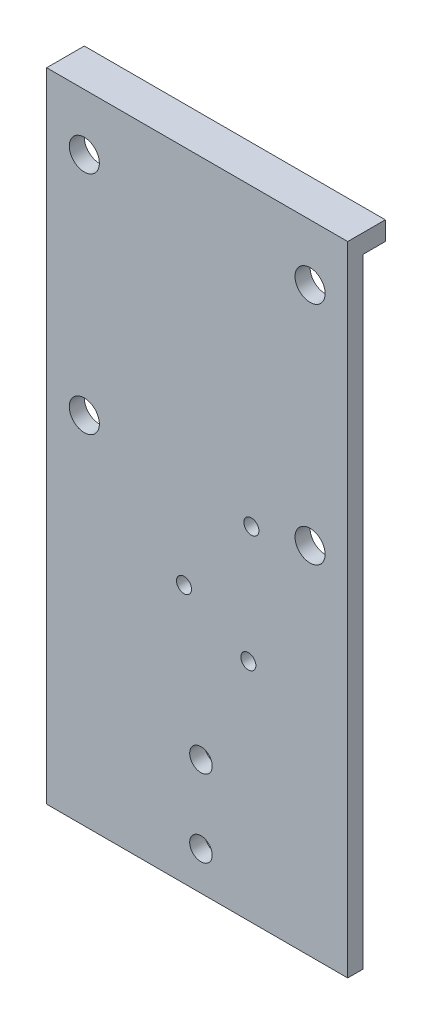
ISO-10303-21;
HEADER;
FILE_DESCRIPTION(('STEP AP214'),'2;1');
FILE_NAME('part.step','',(''),(''),'','','');
FILE_SCHEMA(('AUTOMOTIVE_DESIGN { 1 0 10303 214 1 1 1 1 }'));
ENDSEC;
DATA;
#1=APPLICATION_CONTEXT('core data for automotive mechanical design processes');
#2=APPLICATION_PROTOCOL_DEFINITION('international standard','automotive_design',2000,#1);
#3=PRODUCT_CONTEXT('',#1,'mechanical');
#4=PRODUCT('Part','Part','',(#3));
#5=PRODUCT_RELATED_PRODUCT_CATEGORY('part','',(#4));
#6=PRODUCT_DEFINITION_FORMATION('','',#4);
#7=PRODUCT_DEFINITION_CONTEXT('part definition',#1,'design');
#8=PRODUCT_DEFINITION('design','',#6,#7);
#9=PRODUCT_DEFINITION_SHAPE('','',#8);
#10=(LENGTH_UNIT() NAMED_UNIT(*) SI_UNIT(.MILLI.,.METRE.));
#11=(NAMED_UNIT(*) PLANE_ANGLE_UNIT() SI_UNIT($,.RADIAN.));
#12=(NAMED_UNIT(*) SI_UNIT($,.STERADIAN.) SOLID_ANGLE_UNIT());
#13=UNCERTAINTY_MEASURE_WITH_UNIT(LENGTH_MEASURE(1.E-05),#10,'distance_accuracy_value','');
#14=(GEOMETRIC_REPRESENTATION_CONTEXT(3) GLOBAL_UNCERTAINTY_ASSIGNED_CONTEXT((#13)) GLOBAL_UNIT_ASSIGNED_CONTEXT((#10,
#11,#12)) REPRESENTATION_CONTEXT('',''));
#15=CARTESIAN_POINT('',(0.,0.,0.));
#16=DIRECTION('',(0.,0.,1.));
#17=DIRECTION('',(1.,0.,0.));
#18=AXIS2_PLACEMENT_3D('',#15,#16,#17);
#19=CARTESIAN_POINT('',(0.,0.,0.));
#20=DIRECTION('',(0.,0.,1.));
#21=DIRECTION('',(1.,0.,0.));
#22=AXIS2_PLACEMENT_3D('',#19,#20,#21);
#23=PLANE('',#22);
#24=CARTESIAN_POINT('',(24.5909669585694,-58.8944881889764,0.));
#25=DIRECTION('',(0.,0.,1.));
#26=DIRECTION('',(1.,0.,0.));
#27=AXIS2_PLACEMENT_3D('',#24,#25,#26);
#28=CIRCLE('',#27,2.00000000000001);
#29=CARTESIAN_POINT('',(26.5909669585694,-58.8944881889764,0.));
#30=VERTEX_POINT('',#29);
#31=EDGE_CURVE('E287',#30,#30,#28,.T.);
#32=ORIENTED_EDGE('',*,*,#31,.T.);
#33=EDGE_LOOP('',(#32));
#34=FACE_BOUND('',#33,.T.);
#35=CARTESIAN_POINT('',(25.3909669585694,-27.4944881889764,0.));
#36=DIRECTION('',(0.,0.,1.));
#37=DIRECTION('',(1.,0.,0.));
#38=AXIS2_PLACEMENT_3D('',#35,#36,#37);
#39=CIRCLE('',#38,2.);
#40=CARTESIAN_POINT('',(27.3909669585695,-27.4944881889764,0.));
#41=VERTEX_POINT('',#40);
#42=EDGE_CURVE('E289',#41,#41,#39,.T.);
#43=ORIENTED_EDGE('',*,*,#42,.T.);
#44=EDGE_LOOP('',(#43));
#45=FACE_BOUND('',#44,.T.);
#46=CARTESIAN_POINT('',(7.49096695856945,-49.8944881889764,0.));
#47=DIRECTION('',(0.,0.,1.));
#48=DIRECTION('',(1.,0.,0.));
#49=AXIS2_PLACEMENT_3D('',#46,#47,#48);
#50=CIRCLE('',#49,2.);
#51=CARTESIAN_POINT('',(9.49096695856945,-49.8944881889764,0.));
#52=VERTEX_POINT('',#51);
#53=EDGE_CURVE('E129',#52,#52,#50,.T.);
#54=ORIENTED_EDGE('',*,*,#53,.T.);
#55=EDGE_LOOP('',(#54));
#56=FACE_BOUND('',#55,.T.);
#57=CARTESIAN_POINT('',(-19.0090330414306,35.9055118110236,0.));
#58=DIRECTION('',(0.,0.,1.));
#59=DIRECTION('',(1.,0.,0.));
#60=AXIS2_PLACEMENT_3D('',#57,#58,#59);
#61=CIRCLE('',#60,4.);
#62=CARTESIAN_POINT('',(-15.0090330414306,35.9055118110236,0.));
#63=VERTEX_POINT('',#62);
#64=EDGE_CURVE('E163',#63,#63,#61,.T.);
#65=ORIENTED_EDGE('',*,*,#64,.T.);
#66=EDGE_LOOP('',(#65));
#67=FACE_BOUND('',#66,.T.);
#68=CARTESIAN_POINT('',(40.9909669585695,35.9055118110236,0.));
#69=DIRECTION('',(0.,0.,1.));
#70=DIRECTION('',(1.,0.,0.));
#71=AXIS2_PLACEMENT_3D('',#68,#69,#70);
#72=CIRCLE('',#71,4.00000000000001);
#73=CARTESIAN_POINT('',(44.9909669585695,35.9055118110236,0.));
#74=VERTEX_POINT('',#73);
#75=EDGE_CURVE('E157',#74,#74,#72,.T.);
#76=ORIENTED_EDGE('',*,*,#75,.T.);
#77=EDGE_LOOP('',(#76));
#78=FACE_BOUND('',#77,.T.);
#79=CARTESIAN_POINT('',(-19.0090330414305,-24.0944881889764,0.));
#80=DIRECTION('',(0.,0.,1.));
#81=DIRECTION('',(1.,0.,0.));
#82=AXIS2_PLACEMENT_3D('',#79,#80,#81);
#83=CIRCLE('',#82,4.);
#84=CARTESIAN_POINT('',(-15.0090330414305,-24.0944881889764,0.));
#85=VERTEX_POINT('',#84);
#86=EDGE_CURVE('E151',#85,#85,#83,.T.);
#87=ORIENTED_EDGE('',*,*,#86,.T.);
#88=EDGE_LOOP('',(#87));
#89=FACE_BOUND('',#88,.T.);
#90=CARTESIAN_POINT('',(40.9909669585695,-24.0944881889764,0.));
#91=DIRECTION('',(0.,0.,1.));
#92=DIRECTION('',(1.,0.,0.));
#93=AXIS2_PLACEMENT_3D('',#90,#91,#92);
#94=CIRCLE('',#93,4.);
#95=CARTESIAN_POINT('',(44.9909669585695,-24.0944881889764,0.));
#96=VERTEX_POINT('',#95);
#97=EDGE_CURVE('E145',#96,#96,#94,.T.);
#98=ORIENTED_EDGE('',*,*,#97,.T.);
#99=EDGE_LOOP('',(#98));
#100=FACE_BOUND('',#99,.T.);
#101=CARTESIAN_POINT('',(11.9909669585695,-108.344488188976,0.));
#102=DIRECTION('',(0.,0.,1.));
#103=DIRECTION('',(1.,0.,0.));
#104=AXIS2_PLACEMENT_3D('',#101,#102,#103);
#105=CIRCLE('',#104,3.);
#106=CARTESIAN_POINT('',(14.9909669585695,-108.344488188976,0.));
#107=VERTEX_POINT('',#106);
#108=EDGE_CURVE('E139',#107,#107,#105,.T.);
#109=ORIENTED_EDGE('',*,*,#108,.T.);
#110=EDGE_LOOP('',(#109));
#111=FACE_BOUND('',#110,.T.);
#112=CARTESIAN_POINT('',(11.9909669585695,-87.8444881889764,0.));
#113=DIRECTION('',(0.,0.,1.));
#114=DIRECTION('',(1.,0.,0.));
#115=AXIS2_PLACEMENT_3D('',#112,#113,#114);
#116=CIRCLE('',#115,3.);
#117=CARTESIAN_POINT('',(14.9909669585695,-87.8444881889764,0.));
#118=VERTEX_POINT('',#117);
#119=EDGE_CURVE('E121',#118,#118,#116,.T.);
#120=ORIENTED_EDGE('',*,*,#119,.T.);
#121=EDGE_LOOP('',(#120));
#122=FACE_BOUND('',#121,.T.);
#123=DIRECTION('',(-1.,0.,0.));
#124=VECTOR('',#123,1.);
#125=CARTESIAN_POINT('',(50.9909669585694,45.9055118110236,0.));
#126=LINE('',#125,#124);
#127=CARTESIAN_POINT('',(50.9909669585694,45.9055118110236,0.));
#128=VERTEX_POINT('',#127);
#129=CARTESIAN_POINT('',(-29.0090330414306,45.9055118110236,0.));
#130=VERTEX_POINT('',#129);
#131=EDGE_CURVE('E50',#128,#130,#126,.T.);
#132=ORIENTED_EDGE('',*,*,#131,.F.);
#133=DIRECTION('',(0.,1.,0.));
#134=VECTOR('',#133,1.);
#135=CARTESIAN_POINT('',(50.9909669585694,50.9055118110236,0.));
#136=LINE('',#135,#134);
#137=CARTESIAN_POINT('',(50.9909669585695,-118.594488188976,0.));
#138=VERTEX_POINT('',#137);
#139=EDGE_CURVE('E118',#138,#128,#136,.T.);
#140=ORIENTED_EDGE('',*,*,#139,.F.);
#141=DIRECTION('',(1.,0.,0.));
#142=VECTOR('',#141,1.);
#143=CARTESIAN_POINT('',(-29.0090330414305,-118.594488188976,0.));
#144=LINE('',#143,#142);
#145=CARTESIAN_POINT('',(-29.0090330414305,-118.594488188976,0.));
#146=VERTEX_POINT('',#145);
#147=EDGE_CURVE('E74',#146,#138,#144,.T.);
#148=ORIENTED_EDGE('',*,*,#147,.F.);
#149=DIRECTION('',(0.,-1.,0.));
#150=VECTOR('',#149,1.);
#151=CARTESIAN_POINT('',(-29.0090330414306,50.9055118110236,0.));
#152=LINE('',#151,#150);
#153=EDGE_CURVE('E166',#130,#146,#152,.T.);
#154=ORIENTED_EDGE('',*,*,#153,.F.);
#155=EDGE_LOOP('',(#132,#140,#148,#154));
#156=FACE_BOUND('',#155,.T.);
#157=ADVANCED_FACE('F33',(#34,#45,#56,#67,#78,#89,#100,#111,#122,#156),#23,.F.);
#158=CARTESIAN_POINT('',(-29.0090330414306,50.9055118110236,4.));
#159=DIRECTION('',(1.,0.,0.));
#160=DIRECTION('',(0.,1.,0.));
#161=AXIS2_PLACEMENT_3D('',#158,#159,#160);
#162=PLANE('',#161);
#163=DIRECTION('',(0.,0.,-1.));
#164=VECTOR('',#163,1.);
#165=CARTESIAN_POINT('',(-29.0090330414306,50.9055118110236,4.));
#166=LINE('',#165,#164);
#167=CARTESIAN_POINT('',(-29.0090330414306,50.9055118110236,4.));
#168=VERTEX_POINT('',#167);
#169=CARTESIAN_POINT('',(-29.0090330414306,50.9055118110236,-6.));
#170=VERTEX_POINT('',#169);
#171=EDGE_CURVE('E175',#168,#170,#166,.T.);
#172=ORIENTED_EDGE('',*,*,#171,.T.);
#173=DIRECTION('',(0.,1.,0.));
#174=VECTOR('',#173,1.);
#175=CARTESIAN_POINT('',(-29.0090330414306,50.9055118110236,-6.));
#176=LINE('',#175,#174);
#177=CARTESIAN_POINT('',(-29.0090330414306,45.9055118110236,-6.));
#178=VERTEX_POINT('',#177);
#179=EDGE_CURVE('E106',#178,#170,#176,.T.);
#180=ORIENTED_EDGE('',*,*,#179,.F.);
#181=DIRECTION('',(0.,0.,1.));
#182=VECTOR('',#181,1.);
#183=CARTESIAN_POINT('',(-29.0090330414306,45.9055118110236,-6.));
#184=LINE('',#183,#182);
#185=EDGE_CURVE('E102',#178,#130,#184,.T.);
#186=ORIENTED_EDGE('',*,*,#185,.T.);
#187=ORIENTED_EDGE('',*,*,#153,.T.);
#188=DIRECTION('',(0.,0.,-1.));
#189=VECTOR('',#188,1.);
#190=CARTESIAN_POINT('',(-29.0090330414305,-118.594488188976,4.));
#191=LINE('',#190,#189);
#192=CARTESIAN_POINT('',(-29.0090330414305,-118.594488188976,4.));
#193=VERTEX_POINT('',#192);
#194=EDGE_CURVE('E11',#193,#146,#191,.T.);
#195=ORIENTED_EDGE('',*,*,#194,.F.);
#196=DIRECTION('',(0.,-1.,0.));
#197=VECTOR('',#196,1.);
#198=CARTESIAN_POINT('',(-29.0090330414306,50.9055118110236,4.));
#199=LINE('',#198,#197);
#200=EDGE_CURVE('E169',#168,#193,#199,.T.);
#201=ORIENTED_EDGE('',*,*,#200,.F.);
#202=EDGE_LOOP('',(#172,#180,#186,#187,#195,#201));
#203=FACE_BOUND('',#202,.T.);
#204=ADVANCED_FACE('F35',(#203),#162,.F.);
#205=CARTESIAN_POINT('',(-29.0090330414305,-118.594488188976,4.));
#206=DIRECTION('',(0.,1.,0.));
#207=DIRECTION('',(0.,0.,1.));
#208=AXIS2_PLACEMENT_3D('',#205,#206,#207);
#209=PLANE('',#208);
#210=ORIENTED_EDGE('',*,*,#147,.T.);
#211=DIRECTION('',(0.,0.,-1.));
#212=VECTOR('',#211,1.);
#213=CARTESIAN_POINT('',(50.9909669585695,-118.594488188976,4.));
#214=LINE('',#213,#212);
#215=CARTESIAN_POINT('',(50.9909669585695,-118.594488188976,4.));
#216=VERTEX_POINT('',#215);
#217=EDGE_CURVE('E42',#216,#138,#214,.T.);
#218=ORIENTED_EDGE('',*,*,#217,.F.);
#219=DIRECTION('',(1.,0.,0.));
#220=VECTOR('',#219,1.);
#221=CARTESIAN_POINT('',(-29.0090330414305,-118.594488188976,4.));
#222=LINE('',#221,#220);
#223=EDGE_CURVE('E79',#193,#216,#222,.T.);
#224=ORIENTED_EDGE('',*,*,#223,.F.);
#225=ORIENTED_EDGE('',*,*,#194,.T.);
#226=EDGE_LOOP('',(#210,#218,#224,#225));
#227=FACE_BOUND('',#226,.T.);
#228=ADVANCED_FACE('F190',(#227),#209,.F.);
#229=CARTESIAN_POINT('',(50.9909669585694,50.9055118110236,4.));
#230=DIRECTION('',(-1.,0.,0.));
#231=DIRECTION('',(0.,-1.,0.));
#232=AXIS2_PLACEMENT_3D('',#229,#230,#231);
#233=PLANE('',#232);
#234=ORIENTED_EDGE('',*,*,#139,.T.);
#235=DIRECTION('',(0.,0.,1.));
#236=VECTOR('',#235,1.);
#237=CARTESIAN_POINT('',(50.9909669585694,45.9055118110236,-6.));
#238=LINE('',#237,#236);
#239=CARTESIAN_POINT('',(50.9909669585694,45.9055118110236,-6.));
#240=VERTEX_POINT('',#239);
#241=EDGE_CURVE('E100',#240,#128,#238,.T.);
#242=ORIENTED_EDGE('',*,*,#241,.F.);
#243=DIRECTION('',(0.,-1.,0.));
#244=VECTOR('',#243,1.);
#245=CARTESIAN_POINT('',(50.9909669585694,50.9055118110236,-6.));
#246=LINE('',#245,#244);
#247=CARTESIAN_POINT('',(50.9909669585694,50.9055118110236,-6.));
#248=VERTEX_POINT('',#247);
#249=EDGE_CURVE('E107',#248,#240,#246,.T.);
#250=ORIENTED_EDGE('',*,*,#249,.F.);
#251=DIRECTION('',(0.,0.,-1.));
#252=VECTOR('',#251,1.);
#253=CARTESIAN_POINT('',(50.9909669585694,50.9055118110236,4.));
#254=LINE('',#253,#252);
#255=CARTESIAN_POINT('',(50.9909669585694,50.9055118110236,4.));
#256=VERTEX_POINT('',#255);
#257=EDGE_CURVE('E180',#256,#248,#254,.T.);
#258=ORIENTED_EDGE('',*,*,#257,.F.);
#259=DIRECTION('',(0.,1.,0.));
#260=VECTOR('',#259,1.);
#261=CARTESIAN_POINT('',(50.9909669585694,50.9055118110236,4.));
#262=LINE('',#261,#260);
#263=EDGE_CURVE('E172',#216,#256,#262,.T.);
#264=ORIENTED_EDGE('',*,*,#263,.F.);
#265=ORIENTED_EDGE('',*,*,#217,.T.);
#266=EDGE_LOOP('',(#234,#242,#250,#258,#264,#265));
#267=FACE_BOUND('',#266,.T.);
#268=ADVANCED_FACE('F117',(#267),#233,.F.);
#269=CARTESIAN_POINT('',(-29.0090330414306,50.9055118110236,4.));
#270=DIRECTION('',(0.,-1.,0.));
#271=DIRECTION('',(0.,0.,-1.));
#272=AXIS2_PLACEMENT_3D('',#269,#270,#271);
#273=PLANE('',#272);
#274=ORIENTED_EDGE('',*,*,#257,.T.);
#275=DIRECTION('',(1.,0.,0.));
#276=VECTOR('',#275,1.);
#277=CARTESIAN_POINT('',(50.9909669585694,50.9055118110236,-6.));
#278=LINE('',#277,#276);
#279=EDGE_CURVE('E113',#170,#248,#278,.T.);
#280=ORIENTED_EDGE('',*,*,#279,.F.);
#281=ORIENTED_EDGE('',*,*,#171,.F.);
#282=DIRECTION('',(-1.,0.,0.));
#283=VECTOR('',#282,1.);
#284=CARTESIAN_POINT('',(-29.0090330414306,50.9055118110236,4.));
#285=LINE('',#284,#283);
#286=EDGE_CURVE('E59',#256,#168,#285,.T.);
#287=ORIENTED_EDGE('',*,*,#286,.F.);
#288=EDGE_LOOP('',(#274,#280,#281,#287));
#289=FACE_BOUND('',#288,.T.);
#290=ADVANCED_FACE('F187',(#289),#273,.F.);
#291=CARTESIAN_POINT('',(0.,0.,4.));
#292=DIRECTION('',(0.,0.,1.));
#293=DIRECTION('',(1.,0.,0.));
#294=AXIS2_PLACEMENT_3D('',#291,#292,#293);
#295=PLANE('',#294);
#296=CARTESIAN_POINT('',(24.5909669585694,-58.8944881889764,4.));
#297=DIRECTION('',(0.,0.,1.));
#298=DIRECTION('',(1.,0.,0.));
#299=AXIS2_PLACEMENT_3D('',#296,#297,#298);
#300=CIRCLE('',#299,2.00000000000001);
#301=CARTESIAN_POINT('',(26.5909669585694,-58.8944881889764,4.));
#302=VERTEX_POINT('',#301);
#303=EDGE_CURVE('E224',#302,#302,#300,.T.);
#304=ORIENTED_EDGE('',*,*,#303,.F.);
#305=EDGE_LOOP('',(#304));
#306=FACE_BOUND('',#305,.T.);
#307=CARTESIAN_POINT('',(25.3909669585694,-27.4944881889764,4.));
#308=DIRECTION('',(0.,0.,1.));
#309=DIRECTION('',(1.,0.,0.));
#310=AXIS2_PLACEMENT_3D('',#307,#308,#309);
#311=CIRCLE('',#310,2.);
#312=CARTESIAN_POINT('',(27.3909669585695,-27.4944881889764,4.));
#313=VERTEX_POINT('',#312);
#314=EDGE_CURVE('E228',#313,#313,#311,.T.);
#315=ORIENTED_EDGE('',*,*,#314,.F.);
#316=EDGE_LOOP('',(#315));
#317=FACE_BOUND('',#316,.T.);
#318=CARTESIAN_POINT('',(7.49096695856945,-49.8944881889764,4.));
#319=DIRECTION('',(0.,0.,1.));
#320=DIRECTION('',(1.,0.,0.));
#321=AXIS2_PLACEMENT_3D('',#318,#319,#320);
#322=CIRCLE('',#321,2.);
#323=CARTESIAN_POINT('',(9.49096695856945,-49.8944881889764,4.));
#324=VERTEX_POINT('',#323);
#325=EDGE_CURVE('E232',#324,#324,#322,.T.);
#326=ORIENTED_EDGE('',*,*,#325,.F.);
#327=EDGE_LOOP('',(#326));
#328=FACE_BOUND('',#327,.T.);
#329=CARTESIAN_POINT('',(11.9909669585695,-87.8444881889764,4.));
#330=DIRECTION('',(0.,0.,1.));
#331=DIRECTION('',(1.,0.,0.));
#332=AXIS2_PLACEMENT_3D('',#329,#330,#331);
#333=CIRCLE('',#332,3.);
#334=CARTESIAN_POINT('',(14.9909669585695,-87.8444881889764,4.));
#335=VERTEX_POINT('',#334);
#336=EDGE_CURVE('E119',#335,#335,#333,.T.);
#337=ORIENTED_EDGE('',*,*,#336,.F.);
#338=EDGE_LOOP('',(#337));
#339=FACE_BOUND('',#338,.T.);
#340=CARTESIAN_POINT('',(11.9909669585695,-108.344488188976,4.));
#341=DIRECTION('',(0.,0.,1.));
#342=DIRECTION('',(1.,0.,0.));
#343=AXIS2_PLACEMENT_3D('',#340,#341,#342);
#344=CIRCLE('',#343,3.);
#345=CARTESIAN_POINT('',(14.9909669585695,-108.344488188976,4.));
#346=VERTEX_POINT('',#345);
#347=EDGE_CURVE('E137',#346,#346,#344,.T.);
#348=ORIENTED_EDGE('',*,*,#347,.F.);
#349=EDGE_LOOP('',(#348));
#350=FACE_BOUND('',#349,.T.);
#351=CARTESIAN_POINT('',(40.9909669585695,-24.0944881889764,4.));
#352=DIRECTION('',(0.,0.,1.));
#353=DIRECTION('',(1.,0.,0.));
#354=AXIS2_PLACEMENT_3D('',#351,#352,#353);
#355=CIRCLE('',#354,4.);
#356=CARTESIAN_POINT('',(44.9909669585695,-24.0944881889764,4.));
#357=VERTEX_POINT('',#356);
#358=EDGE_CURVE('E142',#357,#357,#355,.T.);
#359=ORIENTED_EDGE('',*,*,#358,.F.);
#360=EDGE_LOOP('',(#359));
#361=FACE_BOUND('',#360,.T.);
#362=CARTESIAN_POINT('',(-19.0090330414305,-24.0944881889764,4.));
#363=DIRECTION('',(0.,0.,1.));
#364=DIRECTION('',(1.,0.,0.));
#365=AXIS2_PLACEMENT_3D('',#362,#363,#364);
#366=CIRCLE('',#365,4.);
#367=CARTESIAN_POINT('',(-15.0090330414305,-24.0944881889764,4.));
#368=VERTEX_POINT('',#367);
#369=EDGE_CURVE('E148',#368,#368,#366,.T.);
#370=ORIENTED_EDGE('',*,*,#369,.F.);
#371=EDGE_LOOP('',(#370));
#372=FACE_BOUND('',#371,.T.);
#373=CARTESIAN_POINT('',(40.9909669585695,35.9055118110236,4.));
#374=DIRECTION('',(0.,0.,1.));
#375=DIRECTION('',(1.,0.,0.));
#376=AXIS2_PLACEMENT_3D('',#373,#374,#375);
#377=CIRCLE('',#376,4.00000000000001);
#378=CARTESIAN_POINT('',(44.9909669585695,35.9055118110236,4.));
#379=VERTEX_POINT('',#378);
#380=EDGE_CURVE('E154',#379,#379,#377,.T.);
#381=ORIENTED_EDGE('',*,*,#380,.F.);
#382=EDGE_LOOP('',(#381));
#383=FACE_BOUND('',#382,.T.);
#384=CARTESIAN_POINT('',(-19.0090330414306,35.9055118110236,4.));
#385=DIRECTION('',(0.,0.,1.));
#386=DIRECTION('',(1.,0.,0.));
#387=AXIS2_PLACEMENT_3D('',#384,#385,#386);
#388=CIRCLE('',#387,4.);
#389=CARTESIAN_POINT('',(-15.0090330414306,35.9055118110236,4.));
#390=VERTEX_POINT('',#389);
#391=EDGE_CURVE('E160',#390,#390,#388,.T.);
#392=ORIENTED_EDGE('',*,*,#391,.F.);
#393=EDGE_LOOP('',(#392));
#394=FACE_BOUND('',#393,.T.);
#395=ORIENTED_EDGE('',*,*,#200,.T.);
#396=ORIENTED_EDGE('',*,*,#223,.T.);
#397=ORIENTED_EDGE('',*,*,#263,.T.);
#398=ORIENTED_EDGE('',*,*,#286,.T.);
#399=EDGE_LOOP('',(#395,#396,#397,#398));
#400=FACE_BOUND('',#399,.T.);
#401=ADVANCED_FACE('F189',(#306,#317,#328,#339,#350,#361,#372,#383,#394,#400),#295,.T.);
#402=CARTESIAN_POINT('',(-19.0090330414306,35.9055118110236,0.));
#403=DIRECTION('',(0.,0.,1.));
#404=DIRECTION('',(1.,0.,0.));
#405=AXIS2_PLACEMENT_3D('',#402,#403,#404);
#406=CYLINDRICAL_SURFACE('',#405,4.);
#407=ORIENTED_EDGE('',*,*,#64,.F.);
#408=EDGE_LOOP('',(#407));
#409=FACE_BOUND('',#408,.T.);
#410=ORIENTED_EDGE('',*,*,#391,.T.);
#411=EDGE_LOOP('',(#410));
#412=FACE_BOUND('',#411,.T.);
#413=ADVANCED_FACE('F214',(#409,#412),#406,.F.);
#414=CARTESIAN_POINT('',(40.9909669585695,35.9055118110236,0.));
#415=DIRECTION('',(0.,0.,1.));
#416=DIRECTION('',(1.,0.,0.));
#417=AXIS2_PLACEMENT_3D('',#414,#415,#416);
#418=CYLINDRICAL_SURFACE('',#417,4.00000000000001);
#419=ORIENTED_EDGE('',*,*,#75,.F.);
#420=EDGE_LOOP('',(#419));
#421=FACE_BOUND('',#420,.T.);
#422=ORIENTED_EDGE('',*,*,#380,.T.);
#423=EDGE_LOOP('',(#422));
#424=FACE_BOUND('',#423,.T.);
#425=ADVANCED_FACE('F219',(#421,#424),#418,.F.);
#426=CARTESIAN_POINT('',(-19.0090330414305,-24.0944881889764,0.));
#427=DIRECTION('',(0.,0.,1.));
#428=DIRECTION('',(1.,0.,0.));
#429=AXIS2_PLACEMENT_3D('',#426,#427,#428);
#430=CYLINDRICAL_SURFACE('',#429,4.);
#431=ORIENTED_EDGE('',*,*,#86,.F.);
#432=EDGE_LOOP('',(#431));
#433=FACE_BOUND('',#432,.T.);
#434=ORIENTED_EDGE('',*,*,#369,.T.);
#435=EDGE_LOOP('',(#434));
#436=FACE_BOUND('',#435,.T.);
#437=ADVANCED_FACE('F247',(#433,#436),#430,.F.);
#438=CARTESIAN_POINT('',(40.9909669585695,-24.0944881889764,0.));
#439=DIRECTION('',(0.,0.,1.));
#440=DIRECTION('',(1.,0.,0.));
#441=AXIS2_PLACEMENT_3D('',#438,#439,#440);
#442=CYLINDRICAL_SURFACE('',#441,4.);
#443=ORIENTED_EDGE('',*,*,#97,.F.);
#444=EDGE_LOOP('',(#443));
#445=FACE_BOUND('',#444,.T.);
#446=ORIENTED_EDGE('',*,*,#358,.T.);
#447=EDGE_LOOP('',(#446));
#448=FACE_BOUND('',#447,.T.);
#449=ADVANCED_FACE('F253',(#445,#448),#442,.F.);
#450=CARTESIAN_POINT('',(11.9909669585695,-108.344488188976,0.));
#451=DIRECTION('',(0.,0.,1.));
#452=DIRECTION('',(1.,0.,0.));
#453=AXIS2_PLACEMENT_3D('',#450,#451,#452);
#454=CYLINDRICAL_SURFACE('',#453,3.);
#455=ORIENTED_EDGE('',*,*,#108,.F.);
#456=EDGE_LOOP('',(#455));
#457=FACE_BOUND('',#456,.T.);
#458=ORIENTED_EDGE('',*,*,#347,.T.);
#459=EDGE_LOOP('',(#458));
#460=FACE_BOUND('',#459,.T.);
#461=ADVANCED_FACE('F260',(#457,#460),#454,.F.);
#462=CARTESIAN_POINT('',(11.9909669585695,-87.8444881889764,0.));
#463=DIRECTION('',(0.,0.,1.));
#464=DIRECTION('',(1.,0.,0.));
#465=AXIS2_PLACEMENT_3D('',#462,#463,#464);
#466=CYLINDRICAL_SURFACE('',#465,3.);
#467=ORIENTED_EDGE('',*,*,#119,.F.);
#468=EDGE_LOOP('',(#467));
#469=FACE_BOUND('',#468,.T.);
#470=ORIENTED_EDGE('',*,*,#336,.T.);
#471=EDGE_LOOP('',(#470));
#472=FACE_BOUND('',#471,.T.);
#473=ADVANCED_FACE('F264',(#469,#472),#466,.F.);
#474=CARTESIAN_POINT('',(50.9909669585694,45.9055118110236,-6.));
#475=DIRECTION('',(0.,1.,0.));
#476=DIRECTION('',(0.,0.,1.));
#477=AXIS2_PLACEMENT_3D('',#474,#475,#476);
#478=PLANE('',#477);
#479=ORIENTED_EDGE('',*,*,#131,.T.);
#480=ORIENTED_EDGE('',*,*,#185,.F.);
#481=DIRECTION('',(-1.,0.,0.));
#482=VECTOR('',#481,1.);
#483=CARTESIAN_POINT('',(50.9909669585694,45.9055118110236,-6.));
#484=LINE('',#483,#482);
#485=EDGE_CURVE('E96',#240,#178,#484,.T.);
#486=ORIENTED_EDGE('',*,*,#485,.F.);
#487=ORIENTED_EDGE('',*,*,#241,.T.);
#488=EDGE_LOOP('',(#479,#480,#486,#487));
#489=FACE_BOUND('',#488,.T.);
#490=ADVANCED_FACE('F98',(#489),#478,.F.);
#491=CARTESIAN_POINT('',(0.,0.,-6.));
#492=DIRECTION('',(0.,0.,-1.));
#493=DIRECTION('',(-1.,0.,0.));
#494=AXIS2_PLACEMENT_3D('',#491,#492,#493);
#495=PLANE('',#494);
#496=ORIENTED_EDGE('',*,*,#249,.T.);
#497=ORIENTED_EDGE('',*,*,#485,.T.);
#498=ORIENTED_EDGE('',*,*,#179,.T.);
#499=ORIENTED_EDGE('',*,*,#279,.T.);
#500=EDGE_LOOP('',(#496,#497,#498,#499));
#501=FACE_BOUND('',#500,.T.);
#502=ADVANCED_FACE('F111',(#501),#495,.T.);
#503=CARTESIAN_POINT('',(7.49096695856945,-49.8944881889764,-6.000025));
#504=DIRECTION('',(0.,0.,1.));
#505=DIRECTION('',(1.,0.,0.));
#506=AXIS2_PLACEMENT_3D('',#503,#504,#505);
#507=CYLINDRICAL_SURFACE('',#506,2.);
#508=ORIENTED_EDGE('',*,*,#325,.T.);
#509=EDGE_LOOP('',(#508));
#510=FACE_BOUND('',#509,.T.);
#511=ORIENTED_EDGE('',*,*,#53,.F.);
#512=EDGE_LOOP('',(#511));
#513=FACE_BOUND('',#512,.T.);
#514=ADVANCED_FACE('F272',(#510,#513),#507,.F.);
#515=CARTESIAN_POINT('',(25.3909669585694,-27.4944881889764,-6.000025));
#516=DIRECTION('',(0.,0.,1.));
#517=DIRECTION('',(1.,0.,0.));
#518=AXIS2_PLACEMENT_3D('',#515,#516,#517);
#519=CYLINDRICAL_SURFACE('',#518,2.);
#520=ORIENTED_EDGE('',*,*,#314,.T.);
#521=EDGE_LOOP('',(#520));
#522=FACE_BOUND('',#521,.T.);
#523=ORIENTED_EDGE('',*,*,#42,.F.);
#524=EDGE_LOOP('',(#523));
#525=FACE_BOUND('',#524,.T.);
#526=ADVANCED_FACE('F275',(#522,#525),#519,.F.);
#527=CARTESIAN_POINT('',(24.5909669585694,-58.8944881889764,-6.000025));
#528=DIRECTION('',(0.,0.,1.));
#529=DIRECTION('',(1.,0.,0.));
#530=AXIS2_PLACEMENT_3D('',#527,#528,#529);
#531=CYLINDRICAL_SURFACE('',#530,2.00000000000001);
#532=ORIENTED_EDGE('',*,*,#303,.T.);
#533=EDGE_LOOP('',(#532));
#534=FACE_BOUND('',#533,.T.);
#535=ORIENTED_EDGE('',*,*,#31,.F.);
#536=EDGE_LOOP('',(#535));
#537=FACE_BOUND('',#536,.T.);
#538=ADVANCED_FACE('F279',(#534,#537),#531,.F.);
#539=CLOSED_SHELL('',(#157,#204,#228,#268,#290,#401,#413,#425,#437,#449,#461,#473,#490,#502,
#514,#526,#538));
#540=MANIFOLD_SOLID_BREP('B2',#539);
#541=ADVANCED_BREP_SHAPE_REPRESENTATION('',(#18,#540),#14);
#542=SHAPE_DEFINITION_REPRESENTATION(#9,#541);
ENDSEC;
END-ISO-10303-21;
